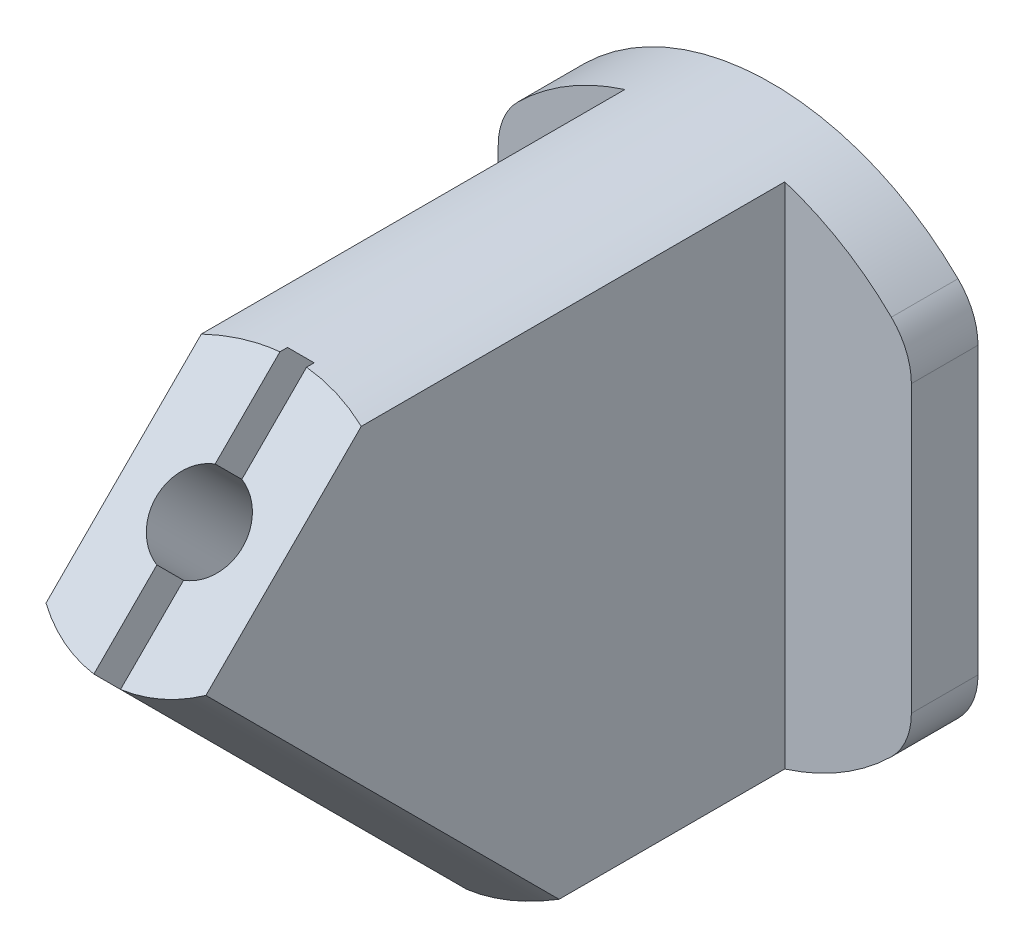
ISO-10303-21;
HEADER;
FILE_DESCRIPTION(('STEP AP214'),'2;1');
FILE_NAME('part.step','',(''),(''),'','','');
FILE_SCHEMA(('AUTOMOTIVE_DESIGN { 1 0 10303 214 1 1 1 1 }'));
ENDSEC;
DATA;
#1=APPLICATION_CONTEXT('core data for automotive mechanical design processes');
#2=APPLICATION_PROTOCOL_DEFINITION('international standard','automotive_design',2000,#1);
#3=PRODUCT_CONTEXT('',#1,'mechanical');
#4=PRODUCT('Part','Part','',(#3));
#5=PRODUCT_RELATED_PRODUCT_CATEGORY('part','',(#4));
#6=PRODUCT_DEFINITION_FORMATION('','',#4);
#7=PRODUCT_DEFINITION_CONTEXT('part definition',#1,'design');
#8=PRODUCT_DEFINITION('design','',#6,#7);
#9=PRODUCT_DEFINITION_SHAPE('','',#8);
#10=(LENGTH_UNIT() NAMED_UNIT(*) SI_UNIT(.MILLI.,.METRE.));
#11=(NAMED_UNIT(*) PLANE_ANGLE_UNIT() SI_UNIT($,.RADIAN.));
#12=(NAMED_UNIT(*) SI_UNIT($,.STERADIAN.) SOLID_ANGLE_UNIT());
#13=UNCERTAINTY_MEASURE_WITH_UNIT(LENGTH_MEASURE(1.E-05),#10,'distance_accuracy_value','');
#14=(GEOMETRIC_REPRESENTATION_CONTEXT(3) GLOBAL_UNCERTAINTY_ASSIGNED_CONTEXT((#13)) GLOBAL_UNIT_ASSIGNED_CONTEXT((#10,
#11,#12)) REPRESENTATION_CONTEXT('',''));
#15=CARTESIAN_POINT('',(0.,0.,0.));
#16=DIRECTION('',(0.,0.,1.));
#17=DIRECTION('',(1.,0.,0.));
#18=AXIS2_PLACEMENT_3D('',#15,#16,#17);
#19=CARTESIAN_POINT('',(0.,0.,50.));
#20=DIRECTION('',(0.,0.,-1.));
#21=DIRECTION('',(-1.,0.,0.));
#22=AXIS2_PLACEMENT_3D('',#19,#20,#21);
#23=CYLINDRICAL_SURFACE('',#22,20.);
#24=DIRECTION('',(0.,0.,-1.));
#25=VECTOR('',#24,1.);
#26=CARTESIAN_POINT('',(-1.00000000000004,-19.9749843554382,50.));
#27=LINE('',#26,#25);
#28=CARTESIAN_POINT('',(-1.00000000000004,-19.9749843554382,14.3982295656959));
#29=VERTEX_POINT('',#28);
#30=CARTESIAN_POINT('',(-1.00000000000004,-19.9749843554382,23.8561759447575));
#31=VERTEX_POINT('',#30);
#32=EDGE_CURVE('E419',#29,#31,#27,.F.);
#33=ORIENTED_EDGE('',*,*,#32,.T.);
#34=CARTESIAN_POINT('',(-1.00000000000005,-19.9749843554382,23.8561759447575));
#35=CARTESIAN_POINT('',(-1.26061484363719,-19.961980122615,23.8315451601963));
#36=CARTESIAN_POINT('',(-1.52005833531843,-19.9438372860367,23.7972385981547));
#37=CARTESIAN_POINT('',(-2.03480101324007,-19.8978867601941,23.7093449996609));
#38=CARTESIAN_POINT('',(-2.29010003174568,-19.8700786807746,23.6557571848823));
#39=CARTESIAN_POINT('',(-2.79473219792378,-19.805410997331,23.5293738184501));
#40=CARTESIAN_POINT('',(-3.04406531315786,-19.7685513441031,23.4565781623835));
#41=CARTESIAN_POINT('',(-3.53496801154571,-19.6866931807613,23.2919293728693));
#42=CARTESIAN_POINT('',(-3.77653805507287,-19.64169515433,23.2000773719375));
#43=CARTESIAN_POINT('',(-4.25052049294367,-19.5446076977182,22.9974067943791));
#44=CARTESIAN_POINT('',(-4.4829197474056,-19.4925085371149,22.8865621382784));
#45=CARTESIAN_POINT('',(-4.93653060131494,-19.3825986027023,22.6463599593305));
#46=CARTESIAN_POINT('',(-5.15774234166405,-19.3247879008545,22.5170026697202));
#47=CARTESIAN_POINT('',(-5.58709268175661,-19.2050514499559,22.2405155355938));
#48=CARTESIAN_POINT('',(-5.79525033598637,-19.1431319836827,22.0934125568282));
#49=CARTESIAN_POINT('',(-6.19737860555173,-19.0167533814306,21.7820755296472));
#50=CARTESIAN_POINT('',(-6.39135475929136,-18.9522952521912,21.6178482303712));
#51=CARTESIAN_POINT('',(-6.74697524903196,-18.8284486095356,21.2889309921683));
#52=CARTESIAN_POINT('',(-6.90995453368032,-18.7691345892171,21.1256524493196));
#53=CARTESIAN_POINT('',(-7.22244179701342,-18.6511189360667,20.7868312406855));
#54=CARTESIAN_POINT('',(-7.37196470116334,-18.5924166902265,20.6113025560532));
#55=CARTESIAN_POINT('',(-7.51453288897558,-18.5346107447797,20.4300189838101));
#56=B_SPLINE_CURVE_WITH_KNOTS('',3,(#34,#35,#36,#37,#38,#39,#40,#41,#42,#43,#44,#45,#46,#47,#48,
#49,#50,#51,#52,#53,#54,#55),.UNSPECIFIED.,.F.,.F.,(4,2,2,2,2,2,2,2,2,2,4),(0.,0.78606803927402,
1.57216781331521,2.35827186064409,3.14432920329607,3.93147468756966,4.7186102556303,
5.50456876715052,6.29021867454424,7.00413334749323,7.71724614573817),.UNSPECIFIED.);
#57=CARTESIAN_POINT('',(-6.,-19.0787840283389,21.9348890760213));
#58=VERTEX_POINT('',#57);
#59=EDGE_CURVE('E267',#31,#58,#56,.T.);
#60=ORIENTED_EDGE('',*,*,#59,.T.);
#61=DIRECTION('',(0.,0.,-1.));
#62=VECTOR('',#61,1.);
#63=CARTESIAN_POINT('',(-5.99999999999999,-19.0787840283389,50.));
#64=LINE('',#63,#62);
#65=CARTESIAN_POINT('',(-6.,-19.0787840283389,5.));
#66=VERTEX_POINT('',#65);
#67=EDGE_CURVE('E299',#58,#66,#64,.T.);
#68=ORIENTED_EDGE('',*,*,#67,.T.);
#69=CARTESIAN_POINT('',(0.,0.,5.));
#70=DIRECTION('',(0.,0.,-1.));
#71=DIRECTION('',(-1.,0.,0.));
#72=AXIS2_PLACEMENT_3D('',#69,#70,#71);
#73=CIRCLE('',#72,20.);
#74=CARTESIAN_POINT('',(-14.,-14.2828568570857,5.));
#75=VERTEX_POINT('',#74);
#76=EDGE_CURVE('E322',#66,#75,#73,.T.);
#77=ORIENTED_EDGE('',*,*,#76,.T.);
#78=DIRECTION('',(0.,0.,-1.));
#79=VECTOR('',#78,1.);
#80=CARTESIAN_POINT('',(-14.,-14.2828568570857,50.));
#81=LINE('',#80,#79);
#82=CARTESIAN_POINT('',(-14.,-14.2828568570857,0.));
#83=VERTEX_POINT('',#82);
#84=EDGE_CURVE('E361',#75,#83,#81,.T.);
#85=ORIENTED_EDGE('',*,*,#84,.T.);
#86=CARTESIAN_POINT('',(0.,0.,0.));
#87=DIRECTION('',(0.,0.,1.));
#88=DIRECTION('',(1.,0.,0.));
#89=AXIS2_PLACEMENT_3D('',#86,#87,#88);
#90=CIRCLE('',#89,20.);
#91=CARTESIAN_POINT('',(-1.00000000000002,-19.9749843554382,0.));
#92=VERTEX_POINT('',#91);
#93=EDGE_CURVE('E335',#83,#92,#90,.T.);
#94=ORIENTED_EDGE('',*,*,#93,.T.);
#95=DIRECTION('',(0.,0.,-1.));
#96=VECTOR('',#95,1.);
#97=CARTESIAN_POINT('',(-1.00000000000001,-19.9749843554382,50.));
#98=LINE('',#97,#96);
#99=CARTESIAN_POINT('',(-1.00000000000002,-19.9749843554382,5.65180172342793));
#100=VERTEX_POINT('',#99);
#101=EDGE_CURVE('E407',#92,#100,#98,.F.);
#102=ORIENTED_EDGE('',*,*,#101,.T.);
#103=CARTESIAN_POINT('',(-1.00000000000002,-19.9749843554382,5.65180172342794));
#104=CARTESIAN_POINT('',(-1.08629569947696,-19.970663732977,5.69559259696993));
#105=CARTESIAN_POINT('',(-1.16992749671595,-19.9659170944513,5.74422186994058));
#106=CARTESIAN_POINT('',(-1.33153417565213,-19.9557899028421,5.84965134634467));
#107=CARTESIAN_POINT('',(-1.40952356597202,-19.9504110762577,5.9064293853275));
#108=CARTESIAN_POINT('',(-1.6333238712017,-19.9337530831377,6.08562699393922));
#109=CARTESIAN_POINT('',(-1.77112341003954,-19.9218342612897,6.21807312897105));
#110=CARTESIAN_POINT('',(-1.98445005016143,-19.9014929564505,6.45550505881144));
#111=CARTESIAN_POINT('',(-2.06572049945984,-19.8931837167284,6.55555526209226));
#112=CARTESIAN_POINT('',(-2.21922182150329,-19.8766449139061,6.76241395397263));
#113=CARTESIAN_POINT('',(-2.29145143469506,-19.8684153620549,6.8692233811414));
#114=CARTESIAN_POINT('',(-2.42773294950043,-19.8522253545787,7.08885451341318));
#115=CARTESIAN_POINT('',(-2.49173014004184,-19.8442669342168,7.20171002314491));
#116=CARTESIAN_POINT('',(-2.61146834849368,-19.82886459313,7.43176487697476));
#117=CARTESIAN_POINT('',(-2.66720727778306,-19.8214208028147,7.54896531062199));
#118=CARTESIAN_POINT('',(-2.79031596506596,-19.8045282738447,7.83174654513227));
#119=CARTESIAN_POINT('',(-2.85413841282428,-19.7953828368126,7.99889598454517));
#120=CARTESIAN_POINT('',(-2.96740856203989,-19.7787196902751,8.33809189766015));
#121=CARTESIAN_POINT('',(-3.01685144961036,-19.7712025260856,8.51013999018446));
#122=CARTESIAN_POINT('',(-3.10163845886224,-19.7580787884182,8.85765064382754));
#123=CARTESIAN_POINT('',(-3.13698951484036,-19.752471275439,9.03311148091393));
#124=CARTESIAN_POINT('',(-3.19364902680687,-19.7433894653863,9.38631405419236));
#125=CARTESIAN_POINT('',(-3.21495928687065,-19.739914894259,9.56405549436095));
#126=CARTESIAN_POINT('',(-3.24348831708312,-19.735247609011,9.92303715751965));
#127=CARTESIAN_POINT('',(-3.25051991243593,-19.7340852084308,10.1042927968312));
#128=CARTESIAN_POINT('',(-3.24942023234832,-19.7342663928387,10.4668046783236));
#129=CARTESIAN_POINT('',(-3.24128626947262,-19.7356104219825,10.6480609149184));
#130=CARTESIAN_POINT('',(-3.20911658222875,-19.740867422648,11.0088659360037));
#131=CARTESIAN_POINT('',(-3.18510614966525,-19.7447763081826,11.1884169762173));
#132=CARTESIAN_POINT('',(-3.12026552032932,-19.7551260729563,11.5442970938017));
#133=CARTESIAN_POINT('',(-3.079444341686,-19.7615655945506,11.7206278458117));
#134=CARTESIAN_POINT('',(-2.96392332335854,-19.7792743268441,12.123689665123));
#135=CARTESIAN_POINT('',(-2.88256809485607,-19.7914291093371,12.3485381593494));
#136=CARTESIAN_POINT('',(-2.68590424438739,-19.8190760099549,12.7827108238843));
#137=CARTESIAN_POINT('',(-2.57063347788327,-19.8345644020618,12.9920519786288));
#138=CARTESIAN_POINT('',(-2.33102897533197,-19.8639805452796,13.346842942818));
#139=CARTESIAN_POINT('',(-2.21317446907071,-19.8775961950206,13.4966771309514));
#140=CARTESIAN_POINT('',(-1.95472527932886,-19.9046688492604,13.774937933541));
#141=CARTESIAN_POINT('',(-1.81419450288269,-19.9181261887792,13.9034227082717));
#142=CARTESIAN_POINT('',(-1.56157904297354,-19.9392027434648,14.0951348638056));
#143=CARTESIAN_POINT('',(-1.45526236780157,-19.9472900315657,14.1659498854087));
#144=CARTESIAN_POINT('',(-1.23386214711476,-19.9622152298095,14.2933691517613));
#145=CARTESIAN_POINT('',(-1.11874837764825,-19.969048530666,14.3499212443625));
#146=CARTESIAN_POINT('',(-1.00000000000004,-19.9749843554382,14.3982295656959));
#147=B_SPLINE_CURVE_WITH_KNOTS('',3,(#103,#104,#105,#106,#107,#108,#109,#110,#111,#112,#113,
#114,#115,#116,#117,#118,#119,#120,#121,#122,#123,#124,#125,#126,#127,#128,#129,#130,#131,#132,
#133,#134,#135,#136,#137,#138,#139,#140,#141,#142,#143,#144,#145,#146),.UNSPECIFIED.,.F.,.F.,(4,
2,2,2,2,2,2,2,2,2,2,2,2,2,2,2,2,2,2,2,2,4),(0.,0.290180291759194,0.579585754191035,
1.1511570716551,1.53823577051911,1.92536833662024,2.31495366572505,2.70463735841513,
3.24136011100491,3.77826233753334,4.3149000385568,4.85146877456127,5.39502697193631,
5.93868150050494,6.48147204706747,7.02397179202366,7.73967456257339,8.45458149912549,
9.02578544862269,9.59540685899327,9.97837609645326,10.3627259896295),.UNSPECIFIED.);
#148=EDGE_CURVE('E408',#100,#29,#147,.T.);
#149=ORIENTED_EDGE('',*,*,#148,.T.);
#150=EDGE_LOOP('',(#33,#60,#68,#77,#85,#94,#102,#149));
#151=FACE_BOUND('',#150,.T.);
#152=ADVANCED_FACE('F33',(#151),#23,.T.);
#153=CARTESIAN_POINT('',(-106.800882059162,1.59436989053374,54.2634944857353));
#154=DIRECTION('',(0.,-0.707106781186547,-0.707106781186548));
#155=DIRECTION('',(0.,0.707106781186548,-0.707106781186547));
#156=AXIS2_PLACEMENT_3D('',#153,#154,#155);
#157=PLANE('',#156);
#158=DIRECTION('',(0.,0.707106781186548,-0.707106781186547));
#159=VECTOR('',#158,1.);
#160=CARTESIAN_POINT('',(-6.,76.5869623694745,-20.7290979932054));
#161=LINE('',#160,#159);
#162=CARTESIAN_POINT('',(-6.,7.42209563595442,48.4357687403147));
#163=VERTEX_POINT('',#162);
#164=CARTESIAN_POINT('',(-5.99999999999999,19.0787840283389,36.7790803479301));
#165=VERTEX_POINT('',#164);
#166=EDGE_CURVE('E56',#163,#165,#161,.T.);
#167=ORIENTED_EDGE('',*,*,#166,.F.);
#168=CARTESIAN_POINT('',(0.,12.9289321881345,42.9289321881346));
#169=DIRECTION('',(0.,-0.707106781186548,-0.707106781186547));
#170=DIRECTION('',(0.,-0.707106781186547,0.707106781186548));
#171=AXIS2_PLACEMENT_3D('',#168,#169,#170);
#172=CIRCLE('',#171,9.83109849532861);
#173=CARTESIAN_POINT('',(-1.00000000000004,6.01335203803672,49.8445123382324));
#174=VERTEX_POINT('',#173);
#175=EDGE_CURVE('E212',#174,#163,#172,.T.);
#176=ORIENTED_EDGE('',*,*,#175,.F.);
#177=DIRECTION('',(0.,-0.707106781186548,0.707106781186547));
#178=VECTOR('',#177,1.);
#179=CARTESIAN_POINT('',(-1.00000000000004,6.01335203803672,49.8445123382324));
#180=LINE('',#179,#178);
#181=CARTESIAN_POINT('',(-1.00000000000004,10.7423252275675,45.1155391487016));
#182=VERTEX_POINT('',#181);
#183=EDGE_CURVE('E199',#182,#174,#180,.T.);
#184=ORIENTED_EDGE('',*,*,#183,.F.);
#185=CARTESIAN_POINT('',(0.,12.9289321881345,42.9289321881346));
#186=DIRECTION('',(0.,0.707106781186548,0.707106781186547));
#187=DIRECTION('',(0.,-0.707106781186547,0.707106781186548));
#188=AXIS2_PLACEMENT_3D('',#185,#186,#187);
#189=CIRCLE('',#188,3.25);
#190=CARTESIAN_POINT('',(-1.00000000000001,15.1155391487015,40.7423252275676));
#191=VERTEX_POINT('',#190);
#192=EDGE_CURVE('E219',#191,#182,#189,.T.);
#193=ORIENTED_EDGE('',*,*,#192,.F.);
#194=DIRECTION('',(0.,0.707106781186548,-0.707106781186547));
#195=VECTOR('',#194,1.);
#196=CARTESIAN_POINT('',(-1.,1.59436989053375,54.2634944857353));
#197=LINE('',#196,#195);
#198=CARTESIAN_POINT('',(-1.00000000000002,19.9749843554382,35.8828800208309));
#199=VERTEX_POINT('',#198);
#200=EDGE_CURVE('E41',#191,#199,#197,.T.);
#201=ORIENTED_EDGE('',*,*,#200,.T.);
#202=CARTESIAN_POINT('',(0.,0.,55.857864376269));
#203=DIRECTION('',(0.,-0.707106781186547,-0.707106781186548));
#204=DIRECTION('',(0.,0.707106781186548,-0.707106781186547));
#205=AXIS2_PLACEMENT_3D('',#202,#203,#204);
#206=ELLIPSE('',#205,28.2842712474619,20.);
#207=EDGE_CURVE('E280',#165,#199,#206,.T.);
#208=ORIENTED_EDGE('',*,*,#207,.F.);
#209=EDGE_LOOP('',(#167,#176,#184,#193,#201,#208));
#210=FACE_BOUND('',#209,.T.);
#211=ADVANCED_FACE('F264',(#210),#157,.F.);
#212=CARTESIAN_POINT('',(0.999999999999985,19.9749843554382,35.8828800208309));
#213=VERTEX_POINT('',#212);
#214=CARTESIAN_POINT('',(6.00000000000001,19.0787840283389,36.7790803479301));
#215=VERTEX_POINT('',#214);
#216=EDGE_CURVE('E279',#213,#215,#206,.T.);
#217=ORIENTED_EDGE('',*,*,#216,.F.);
#218=DIRECTION('',(0.,0.707106781186547,-0.707106781186547));
#219=VECTOR('',#218,1.);
#220=CARTESIAN_POINT('',(0.999999999999985,15.1155391487015,40.7423252275676));
#221=LINE('',#220,#219);
#222=CARTESIAN_POINT('',(0.999999999999985,15.1155391487015,40.7423252275676));
#223=VERTEX_POINT('',#222);
#224=EDGE_CURVE('E214',#223,#213,#221,.T.);
#225=ORIENTED_EDGE('',*,*,#224,.F.);
#226=CARTESIAN_POINT('',(0.,12.9289321881345,42.9289321881346));
#227=DIRECTION('',(0.,0.707106781186548,0.707106781186547));
#228=DIRECTION('',(0.,-0.707106781186547,0.707106781186548));
#229=AXIS2_PLACEMENT_3D('',#226,#227,#228);
#230=CIRCLE('',#229,3.25000000000001);
#231=CARTESIAN_POINT('',(0.999999999999962,10.7423252275675,45.1155391487016));
#232=VERTEX_POINT('',#231);
#233=EDGE_CURVE('E211',#232,#223,#230,.T.);
#234=ORIENTED_EDGE('',*,*,#233,.F.);
#235=DIRECTION('',(0.,0.707106781186548,-0.707106781186548));
#236=VECTOR('',#235,1.);
#237=CARTESIAN_POINT('',(0.999999999999963,6.01335203803672,49.8445123382324));
#238=LINE('',#237,#236);
#239=CARTESIAN_POINT('',(0.999999999999963,6.01335203803672,49.8445123382324));
#240=VERTEX_POINT('',#239);
#241=EDGE_CURVE('E193',#240,#232,#238,.T.);
#242=ORIENTED_EDGE('',*,*,#241,.F.);
#243=CARTESIAN_POINT('',(0.,12.9289321881345,42.9289321881346));
#244=DIRECTION('',(0.,-0.707106781186547,-0.707106781186548));
#245=DIRECTION('',(0.,0.707106781186548,-0.707106781186547));
#246=AXIS2_PLACEMENT_3D('',#243,#244,#245);
#247=CIRCLE('',#246,9.83109849532864);
#248=CARTESIAN_POINT('',(6.00000000000001,7.42209563595444,48.4357687403146));
#249=VERTEX_POINT('',#248);
#250=EDGE_CURVE('E201',#240,#249,#247,.F.);
#251=ORIENTED_EDGE('',*,*,#250,.T.);
#252=DIRECTION('',(0.,-0.707106781186548,0.707106781186547));
#253=VECTOR('',#252,1.);
#254=CARTESIAN_POINT('',(6.00000000000001,52.208573355544,3.64929102072501));
#255=LINE('',#254,#253);
#256=EDGE_CURVE('E283',#215,#249,#255,.T.);
#257=ORIENTED_EDGE('',*,*,#256,.F.);
#258=EDGE_LOOP('',(#217,#225,#234,#242,#251,#257));
#259=FACE_BOUND('',#258,.T.);
#260=ADVANCED_FACE('F208',(#259),#157,.F.);
#261=CARTESIAN_POINT('',(-10.5,10.7121426428143,50.));
#262=DIRECTION('',(0.,0.,-1.));
#263=DIRECTION('',(-1.,0.,0.));
#264=AXIS2_PLACEMENT_3D('',#261,#262,#263);
#265=CYLINDRICAL_SURFACE('',#264,5.);
#266=DIRECTION('',(0.,0.,-1.));
#267=VECTOR('',#266,1.);
#268=CARTESIAN_POINT('',(-15.5,10.7121426428143,50.));
#269=LINE('',#268,#267);
#270=CARTESIAN_POINT('',(-15.5,10.7121426428143,5.));
#271=VERTEX_POINT('',#270);
#272=CARTESIAN_POINT('',(-15.5,10.7121426428143,0.));
#273=VERTEX_POINT('',#272);
#274=EDGE_CURVE('E365',#271,#273,#269,.T.);
#275=ORIENTED_EDGE('',*,*,#274,.F.);
#276=CARTESIAN_POINT('',(-10.5,10.7121426428143,5.));
#277=DIRECTION('',(0.,0.,-1.));
#278=DIRECTION('',(-1.,0.,0.));
#279=AXIS2_PLACEMENT_3D('',#276,#277,#278);
#280=CIRCLE('',#279,5.);
#281=CARTESIAN_POINT('',(-14.,14.2828568570857,5.));
#282=VERTEX_POINT('',#281);
#283=EDGE_CURVE('E313',#271,#282,#280,.T.);
#284=ORIENTED_EDGE('',*,*,#283,.T.);
#285=DIRECTION('',(0.,0.,-1.));
#286=VECTOR('',#285,1.);
#287=CARTESIAN_POINT('',(-14.,14.2828568570857,50.));
#288=LINE('',#287,#286);
#289=CARTESIAN_POINT('',(-14.,14.2828568570857,0.));
#290=VERTEX_POINT('',#289);
#291=EDGE_CURVE('E350',#282,#290,#288,.T.);
#292=ORIENTED_EDGE('',*,*,#291,.T.);
#293=CARTESIAN_POINT('',(-10.5,10.7121426428143,0.));
#294=DIRECTION('',(0.,0.,1.));
#295=DIRECTION('',(-1.,0.,0.));
#296=AXIS2_PLACEMENT_3D('',#293,#294,#295);
#297=CIRCLE('',#296,5.);
#298=EDGE_CURVE('E325',#290,#273,#297,.T.);
#299=ORIENTED_EDGE('',*,*,#298,.T.);
#300=EDGE_LOOP('',(#275,#284,#292,#299));
#301=FACE_BOUND('',#300,.T.);
#302=ADVANCED_FACE('F35',(#301),#265,.T.);
#303=CARTESIAN_POINT('',(-15.5,10.7121426428143,50.));
#304=DIRECTION('',(1.,0.,0.));
#305=DIRECTION('',(0.,1.,0.));
#306=AXIS2_PLACEMENT_3D('',#303,#304,#305);
#307=PLANE('',#306);
#308=DIRECTION('',(0.,0.,-1.));
#309=VECTOR('',#308,1.);
#310=CARTESIAN_POINT('',(-15.5,-10.7121426428143,50.));
#311=LINE('',#310,#309);
#312=CARTESIAN_POINT('',(-15.5,-10.7121426428143,5.));
#313=VERTEX_POINT('',#312);
#314=CARTESIAN_POINT('',(-15.5,-10.7121426428143,0.));
#315=VERTEX_POINT('',#314);
#316=EDGE_CURVE('E363',#313,#315,#311,.T.);
#317=ORIENTED_EDGE('',*,*,#316,.F.);
#318=DIRECTION('',(0.,1.,0.));
#319=VECTOR('',#318,1.);
#320=CARTESIAN_POINT('',(-15.5,10.7121426428143,5.));
#321=LINE('',#320,#319);
#322=EDGE_CURVE('E316',#313,#271,#321,.T.);
#323=ORIENTED_EDGE('',*,*,#322,.T.);
#324=ORIENTED_EDGE('',*,*,#274,.T.);
#325=DIRECTION('',(0.,-1.,0.));
#326=VECTOR('',#325,1.);
#327=CARTESIAN_POINT('',(-15.5,10.7121426428143,0.));
#328=LINE('',#327,#326);
#329=EDGE_CURVE('E328',#273,#315,#328,.T.);
#330=ORIENTED_EDGE('',*,*,#329,.T.);
#331=EDGE_LOOP('',(#317,#323,#324,#330));
#332=FACE_BOUND('',#331,.T.);
#333=ADVANCED_FACE('F473',(#332),#307,.F.);
#334=CARTESIAN_POINT('',(-10.5,-10.7121426428143,50.));
#335=DIRECTION('',(0.,0.,-1.));
#336=DIRECTION('',(-1.,0.,0.));
#337=AXIS2_PLACEMENT_3D('',#334,#335,#336);
#338=CYLINDRICAL_SURFACE('',#337,5.);
#339=ORIENTED_EDGE('',*,*,#84,.F.);
#340=CARTESIAN_POINT('',(-10.5,-10.7121426428143,5.));
#341=DIRECTION('',(0.,0.,-1.));
#342=DIRECTION('',(-1.,0.,0.));
#343=AXIS2_PLACEMENT_3D('',#340,#341,#342);
#344=CIRCLE('',#343,5.);
#345=EDGE_CURVE('E319',#75,#313,#344,.T.);
#346=ORIENTED_EDGE('',*,*,#345,.T.);
#347=ORIENTED_EDGE('',*,*,#316,.T.);
#348=CARTESIAN_POINT('',(-10.5,-10.7121426428143,0.));
#349=DIRECTION('',(0.,0.,1.));
#350=DIRECTION('',(-1.,0.,0.));
#351=AXIS2_PLACEMENT_3D('',#348,#349,#350);
#352=CIRCLE('',#351,5.);
#353=EDGE_CURVE('E331',#315,#83,#352,.T.);
#354=ORIENTED_EDGE('',*,*,#353,.T.);
#355=EDGE_LOOP('',(#339,#346,#347,#354));
#356=FACE_BOUND('',#355,.T.);
#357=ADVANCED_FACE('F395',(#356),#338,.T.);
#358=CARTESIAN_POINT('',(0.999999999999958,-19.9749843554382,14.3982295656959));
#359=CARTESIAN_POINT('',(1.08309943391349,-19.9708273263609,14.3644051114189));
#360=CARTESIAN_POINT('',(1.16448348097414,-19.9662300926852,14.3265302725674));
#361=CARTESIAN_POINT('',(1.32323641218614,-19.9563355791693,14.2434007207358));
#362=CARTESIAN_POINT('',(1.40060969302619,-19.9510390894802,14.1981543242196));
#363=CARTESIAN_POINT('',(1.55033069822167,-19.9399617876196,14.1013211174988));
#364=CARTESIAN_POINT('',(1.62271433271063,-19.9341852883141,14.0497891585875));
#365=CARTESIAN_POINT('',(1.76283118120077,-19.9222832152384,13.940790391359));
#366=CARTESIAN_POINT('',(1.83056315543115,-19.9161575491976,13.8833220109947));
#367=CARTESIAN_POINT('',(2.02581958534337,-19.897565585245,13.7035777608381));
#368=CARTESIAN_POINT('',(2.14619258720513,-19.8848228600582,13.5734421306163));
#369=CARTESIAN_POINT('',(2.36714568226862,-19.8597337204937,13.2971019100972));
#370=CARTESIAN_POINT('',(2.46767732216745,-19.8473883364327,13.1508593090841));
#371=CARTESIAN_POINT('',(2.6921580240988,-19.8184419004031,12.774542624273));
#372=CARTESIAN_POINT('',(2.80466100762493,-19.8025931148026,12.5375583005929));
#373=CARTESIAN_POINT('',(2.9902377648534,-19.7754203299436,12.0483563666018));
#374=CARTESIAN_POINT('',(3.06324184254092,-19.7641043378947,11.796112697102));
#375=CARTESIAN_POINT('',(3.15412141984755,-19.7497525612701,11.3729399492929));
#376=CARTESIAN_POINT('',(3.18233622678934,-19.7452060882847,11.2041679291963));
#377=CARTESIAN_POINT('',(3.22428333692096,-19.7384009628009,10.8647879113649));
#378=CARTESIAN_POINT('',(3.23801624126664,-19.7361422153374,10.6941799901368));
#379=CARTESIAN_POINT('',(3.25171596186807,-19.7338891491343,10.3522689394469));
#380=CARTESIAN_POINT('',(3.25167023542481,-19.7338968935841,10.1809653185093));
#381=CARTESIAN_POINT('',(3.23831317400647,-19.7360931665682,9.83891650900548));
#382=CARTESIAN_POINT('',(3.22500319437094,-19.738281472293,9.66817126517279));
#383=CARTESIAN_POINT('',(3.18515578903495,-19.7447511101505,9.32573021705338));
#384=CARTESIAN_POINT('',(3.15842703243115,-19.7490626995384,9.15405726098273));
#385=CARTESIAN_POINT('',(3.09176117521729,-19.7596091001104,8.81332665701793));
#386=CARTESIAN_POINT('',(3.05182203216057,-19.7658442086781,8.64426941777102));
#387=CARTESIAN_POINT('',(2.95858983336806,-19.7800146037173,8.30988628205706));
#388=CARTESIAN_POINT('',(2.90529412578622,-19.787950227768,8.14456113368262));
#389=CARTESIAN_POINT('',(2.78499677092803,-19.8052384482535,7.81914552972558));
#390=CARTESIAN_POINT('',(2.7180005794339,-19.8145904802656,7.65905301975336));
#391=CARTESIAN_POINT('',(2.54477437345051,-19.8376967275674,7.29328589637239));
#392=CARTESIAN_POINT('',(2.43291106233684,-19.8518790125195,7.09021231353158));
#393=CARTESIAN_POINT('',(2.24451240591393,-19.8737534696668,6.79982727892798));
#394=CARTESIAN_POINT('',(2.17846572287625,-19.8811263335611,6.70561672487122));
#395=CARTESIAN_POINT('',(2.03909147061228,-19.895904869409,6.52275253813905));
#396=CARTESIAN_POINT('',(1.96576375369825,-19.9033105420252,6.43409901824148));
#397=CARTESIAN_POINT('',(1.76241380700114,-19.9225997394516,6.20948040878453));
#398=CARTESIAN_POINT('',(1.62590396172749,-19.9343478798865,6.0791226337851));
#399=CARTESIAN_POINT('',(1.40449106835079,-19.9507629307952,5.90270178574542));
#400=CARTESIAN_POINT('',(1.32740056011803,-19.9560613811595,5.84680536924096));
#401=CARTESIAN_POINT('',(1.1677467698759,-19.9660407662389,5.742954896422));
#402=CARTESIAN_POINT('',(1.08517008763295,-19.9707200986935,5.69502136905447));
#403=CARTESIAN_POINT('',(1.00000000000002,-19.9749843554382,5.65180172342792));
#404=B_SPLINE_CURVE_WITH_KNOTS('',3,(#358,#359,#360,#361,#362,#363,#364,#365,#366,#367,#368,
#369,#370,#371,#372,#373,#374,#375,#376,#377,#378,#379,#380,#381,#382,#383,#384,#385,#386,#387,
#388,#389,#390,#391,#392,#393,#394,#395,#396,#397,#398,#399,#400,#401,#402,#403),.UNSPECIFIED.,
.F.,.F.,(4,2,2,2,2,2,2,2,2,2,2,2,2,2,2,2,2,2,2,2,2,2,4),(0.,0.26927905916395,0.538256399716448,
0.805035056934124,1.07188454285029,1.60277815917949,2.13495261684007,2.91907318641967,
3.70457286541395,4.2174973405839,4.73040052299251,5.24377060300161,5.7570882323049,
6.27794217727792,6.79887668870939,7.31991470984681,7.84074564678988,8.53524657409563,
8.88080781501584,9.2263760666972,9.79086480296107,10.0765436944216,10.3629480272789),.UNSPECIFIED.);
#405=CARTESIAN_POINT('',(0.99999999999996,-19.9749843554382,14.3982295656959));
#406=VERTEX_POINT('',#405);
#407=CARTESIAN_POINT('',(0.99999999999998,-19.9749843554382,5.65180172342795));
#408=VERTEX_POINT('',#407);
#409=EDGE_CURVE('E439',#406,#408,#404,.T.);
#410=ORIENTED_EDGE('',*,*,#409,.T.);
#411=DIRECTION('',(0.,0.,-1.));
#412=VECTOR('',#411,1.);
#413=CARTESIAN_POINT('',(0.999999999999982,-19.9749843554382,50.));
#414=LINE('',#413,#412);
#415=CARTESIAN_POINT('',(0.999999999999981,-19.9749843554382,0.));
#416=VERTEX_POINT('',#415);
#417=EDGE_CURVE('E447',#408,#416,#414,.T.);
#418=ORIENTED_EDGE('',*,*,#417,.T.);
#419=CARTESIAN_POINT('',(14.,-14.2828568570857,0.));
#420=VERTEX_POINT('',#419);
#421=EDGE_CURVE('E334',#416,#420,#90,.T.);
#422=ORIENTED_EDGE('',*,*,#421,.T.);
#423=DIRECTION('',(0.,0.,-1.));
#424=VECTOR('',#423,1.);
#425=CARTESIAN_POINT('',(14.,-14.2828568570857,50.));
#426=LINE('',#425,#424);
#427=CARTESIAN_POINT('',(14.,-14.2828568570857,5.));
#428=VERTEX_POINT('',#427);
#429=EDGE_CURVE('E358',#428,#420,#426,.T.);
#430=ORIENTED_EDGE('',*,*,#429,.F.);
#431=CARTESIAN_POINT('',(0.,0.,5.));
#432=DIRECTION('',(0.,0.,-1.));
#433=DIRECTION('',(-1.,0.,0.));
#434=AXIS2_PLACEMENT_3D('',#431,#432,#433);
#435=CIRCLE('',#434,20.);
#436=CARTESIAN_POINT('',(6.,-19.0787840283389,5.));
#437=VERTEX_POINT('',#436);
#438=EDGE_CURVE('E310',#428,#437,#435,.T.);
#439=ORIENTED_EDGE('',*,*,#438,.T.);
#440=DIRECTION('',(0.,0.,-1.));
#441=VECTOR('',#440,1.);
#442=CARTESIAN_POINT('',(6.00000000000001,-19.0787840283389,50.));
#443=LINE('',#442,#441);
#444=CARTESIAN_POINT('',(6.00000000000001,-19.0787840283389,21.9348890760213));
#445=VERTEX_POINT('',#444);
#446=EDGE_CURVE('E293',#437,#445,#443,.F.);
#447=ORIENTED_EDGE('',*,*,#446,.T.);
#448=CARTESIAN_POINT('',(9.29392882690882,-17.7094010898266,16.8234533276913));
#449=CARTESIAN_POINT('',(9.21814810518967,-17.7491272537367,17.0945634259947));
#450=CARTESIAN_POINT('',(9.13331491097292,-17.793069163275,17.3626332588574));
#451=CARTESIAN_POINT('',(8.94464557930893,-17.8886817075979,17.89081910672));
#452=CARTESIAN_POINT('',(8.8407939900257,-17.9403586205431,18.1509284520543));
#453=CARTESIAN_POINT('',(8.61306145856946,-18.0507920904557,18.6614297902238));
#454=CARTESIAN_POINT('',(8.48913709641536,-18.1095639228253,18.9117992247156));
#455=CARTESIAN_POINT('',(8.22105750233794,-18.2328272559827,19.3999139378202));
#456=CARTESIAN_POINT('',(8.07690809107953,-18.2973171091952,19.6376628215235));
#457=CARTESIAN_POINT('',(7.76755961174559,-18.4307762756594,20.0996521062085));
#458=CARTESIAN_POINT('',(7.60225414641745,-18.499767301261,20.3238151496466));
#459=CARTESIAN_POINT('',(7.2516794063148,-18.6399776899395,20.7552569727696));
#460=CARTESIAN_POINT('',(7.06640791957954,-18.7111972992914,20.9625338772264));
#461=CARTESIAN_POINT('',(6.67726098352071,-18.8535676447533,21.358050350074));
#462=CARTESIAN_POINT('',(6.47342047437307,-18.92471826565,21.5463243227491));
#463=CARTESIAN_POINT('',(6.04825355387676,-19.0648550347502,21.902836949252));
#464=CARTESIAN_POINT('',(5.82692901805999,-19.1338414140083,22.0710777472203));
#465=CARTESIAN_POINT('',(5.38722251824211,-19.2620331438509,22.3735953665029));
#466=CARTESIAN_POINT('',(5.1700722209802,-19.3215773618311,22.5095230291742));
#467=CARTESIAN_POINT('',(4.72399424588288,-19.4354535971434,22.7629877989461));
#468=CARTESIAN_POINT('',(4.49506680063177,-19.4897857173473,22.8805252690456));
#469=CARTESIAN_POINT('',(4.02700886535826,-19.5918496928964,23.0968184238145));
#470=CARTESIAN_POINT('',(3.78787554626987,-19.6395797023829,23.1955688587743));
#471=CARTESIAN_POINT('',(3.30129152629112,-19.7272046494429,23.3739418488273));
#472=CARTESIAN_POINT('',(3.05384311079907,-19.7671017195967,23.453569611542));
#473=CARTESIAN_POINT('',(2.50928360566408,-19.8441778209432,23.6055687929058));
#474=CARTESIAN_POINT('',(2.21092513224937,-19.8797210929826,23.6743618249337));
#475=CARTESIAN_POINT('',(1.75928517128955,-19.9230465507914,23.7575188904441));
#476=CARTESIAN_POINT('',(1.6082344604971,-19.9358143127991,23.7818822741987));
#477=CARTESIAN_POINT('',(1.30493201370746,-19.9579629099341,23.8239932859335));
#478=CARTESIAN_POINT('',(1.1526800145079,-19.967342980504,23.8417394205168));
#479=CARTESIAN_POINT('',(0.999999999999959,-19.9749843554382,23.8561759447575));
#480=B_SPLINE_CURVE_WITH_KNOTS('',3,(#448,#449,#450,#451,#452,#453,#454,#455,#456,#457,#458,
#459,#460,#461,#462,#463,#464,#465,#466,#467,#468,#469,#470,#471,#472,#473,#474,#475,#476,#477,
#478,#479),.UNSPECIFIED.,.F.,.F.,(4,2,2,2,2,2,2,2,2,2,2,2,2,2,2,4),(0.,0.852838655877133,
1.70637331494434,2.56177956003447,3.41694012666378,4.27658414398284,5.13632349614002,
5.99447728907258,6.85253915152525,7.64063289595651,8.42871108246764,9.21700916128635,
10.0050923211354,10.9281467987226,11.3885946418398,11.8491463371452),.UNSPECIFIED.);
#481=CARTESIAN_POINT('',(0.99999999999996,-19.9749843554382,23.8561759447575));
#482=VERTEX_POINT('',#481);
#483=EDGE_CURVE('E240',#445,#482,#480,.T.);
#484=ORIENTED_EDGE('',*,*,#483,.T.);
#485=DIRECTION('',(0.,0.,-1.));
#486=VECTOR('',#485,1.);
#487=CARTESIAN_POINT('',(0.999999999999961,-19.9749843554382,50.));
#488=LINE('',#487,#486);
#489=EDGE_CURVE('E196',#482,#406,#488,.T.);
#490=ORIENTED_EDGE('',*,*,#489,.T.);
#491=EDGE_LOOP('',(#410,#418,#422,#430,#439,#447,#484,#490));
#492=FACE_BOUND('',#491,.T.);
#493=ADVANCED_FACE('F248',(#492),#23,.T.);
#494=CARTESIAN_POINT('',(10.5,-10.7121426428143,50.));
#495=DIRECTION('',(0.,0.,-1.));
#496=DIRECTION('',(-1.,0.,0.));
#497=AXIS2_PLACEMENT_3D('',#494,#495,#496);
#498=CYLINDRICAL_SURFACE('',#497,5.);
#499=DIRECTION('',(0.,0.,-1.));
#500=VECTOR('',#499,1.);
#501=CARTESIAN_POINT('',(15.5,-10.7121426428143,50.));
#502=LINE('',#501,#500);
#503=CARTESIAN_POINT('',(15.5,-10.7121426428143,5.));
#504=VERTEX_POINT('',#503);
#505=CARTESIAN_POINT('',(15.5,-10.7121426428143,0.));
#506=VERTEX_POINT('',#505);
#507=EDGE_CURVE('E356',#504,#506,#502,.T.);
#508=ORIENTED_EDGE('',*,*,#507,.F.);
#509=CARTESIAN_POINT('',(10.5,-10.7121426428143,5.));
#510=DIRECTION('',(0.,0.,-1.));
#511=DIRECTION('',(-1.,0.,0.));
#512=AXIS2_PLACEMENT_3D('',#509,#510,#511);
#513=CIRCLE('',#512,5.);
#514=EDGE_CURVE('E307',#504,#428,#513,.T.);
#515=ORIENTED_EDGE('',*,*,#514,.T.);
#516=ORIENTED_EDGE('',*,*,#429,.T.);
#517=CARTESIAN_POINT('',(10.5,-10.7121426428143,0.));
#518=DIRECTION('',(0.,0.,1.));
#519=DIRECTION('',(-1.,0.,0.));
#520=AXIS2_PLACEMENT_3D('',#517,#518,#519);
#521=CIRCLE('',#520,5.);
#522=EDGE_CURVE('E338',#420,#506,#521,.T.);
#523=ORIENTED_EDGE('',*,*,#522,.T.);
#524=EDGE_LOOP('',(#508,#515,#516,#523));
#525=FACE_BOUND('',#524,.T.);
#526=ADVANCED_FACE('F484',(#525),#498,.T.);
#527=CARTESIAN_POINT('',(15.5,10.7121426428143,50.));
#528=DIRECTION('',(-1.,0.,0.));
#529=DIRECTION('',(0.,-1.,0.));
#530=AXIS2_PLACEMENT_3D('',#527,#528,#529);
#531=PLANE('',#530);
#532=DIRECTION('',(0.,0.,-1.));
#533=VECTOR('',#532,1.);
#534=CARTESIAN_POINT('',(15.5,10.7121426428143,50.));
#535=LINE('',#534,#533);
#536=CARTESIAN_POINT('',(15.5,10.7121426428143,5.));
#537=VERTEX_POINT('',#536);
#538=CARTESIAN_POINT('',(15.5,10.7121426428143,0.));
#539=VERTEX_POINT('',#538);
#540=EDGE_CURVE('E354',#537,#539,#535,.T.);
#541=ORIENTED_EDGE('',*,*,#540,.F.);
#542=DIRECTION('',(0.,-1.,0.));
#543=VECTOR('',#542,1.);
#544=CARTESIAN_POINT('',(15.5,10.7121426428143,5.));
#545=LINE('',#544,#543);
#546=EDGE_CURVE('E304',#537,#504,#545,.T.);
#547=ORIENTED_EDGE('',*,*,#546,.T.);
#548=ORIENTED_EDGE('',*,*,#507,.T.);
#549=DIRECTION('',(0.,1.,0.));
#550=VECTOR('',#549,1.);
#551=CARTESIAN_POINT('',(15.5,10.7121426428143,0.));
#552=LINE('',#551,#550);
#553=EDGE_CURVE('E341',#506,#539,#552,.T.);
#554=ORIENTED_EDGE('',*,*,#553,.T.);
#555=EDGE_LOOP('',(#541,#547,#548,#554));
#556=FACE_BOUND('',#555,.T.);
#557=ADVANCED_FACE('F463',(#556),#531,.F.);
#558=CARTESIAN_POINT('',(10.5,10.7121426428143,50.));
#559=DIRECTION('',(0.,0.,-1.));
#560=DIRECTION('',(-1.,0.,0.));
#561=AXIS2_PLACEMENT_3D('',#558,#559,#560);
#562=CYLINDRICAL_SURFACE('',#561,5.);
#563=DIRECTION('',(0.,0.,-1.));
#564=VECTOR('',#563,1.);
#565=CARTESIAN_POINT('',(14.,14.2828568570857,50.));
#566=LINE('',#565,#564);
#567=CARTESIAN_POINT('',(14.,14.2828568570857,5.));
#568=VERTEX_POINT('',#567);
#569=CARTESIAN_POINT('',(14.,14.2828568570857,0.));
#570=VERTEX_POINT('',#569);
#571=EDGE_CURVE('E352',#568,#570,#566,.T.);
#572=ORIENTED_EDGE('',*,*,#571,.F.);
#573=CARTESIAN_POINT('',(10.5,10.7121426428143,5.));
#574=DIRECTION('',(0.,0.,-1.));
#575=DIRECTION('',(-1.,0.,0.));
#576=AXIS2_PLACEMENT_3D('',#573,#574,#575);
#577=CIRCLE('',#576,5.);
#578=EDGE_CURVE('E301',#568,#537,#577,.T.);
#579=ORIENTED_EDGE('',*,*,#578,.T.);
#580=ORIENTED_EDGE('',*,*,#540,.T.);
#581=CARTESIAN_POINT('',(10.5,10.7121426428143,0.));
#582=DIRECTION('',(0.,0.,1.));
#583=DIRECTION('',(1.,0.,0.));
#584=AXIS2_PLACEMENT_3D('',#581,#582,#583);
#585=CIRCLE('',#584,5.);
#586=EDGE_CURVE('E344',#539,#570,#585,.T.);
#587=ORIENTED_EDGE('',*,*,#586,.T.);
#588=EDGE_LOOP('',(#572,#579,#580,#587));
#589=FACE_BOUND('',#588,.T.);
#590=ADVANCED_FACE('F461',(#589),#562,.T.);
#591=CARTESIAN_POINT('',(0.,0.,50.));
#592=DIRECTION('',(0.,0.,-1.));
#593=DIRECTION('',(-1.,0.,0.));
#594=AXIS2_PLACEMENT_3D('',#591,#592,#593);
#595=CYLINDRICAL_SURFACE('',#594,20.);
#596=ORIENTED_EDGE('',*,*,#207,.T.);
#597=DIRECTION('',(0.,0.,-1.));
#598=VECTOR('',#597,1.);
#599=CARTESIAN_POINT('',(-1.00000000000001,19.9749843554382,50.));
#600=LINE('',#599,#598);
#601=CARTESIAN_POINT('',(-1.00000000000002,19.9749843554382,35.3135150359721));
#602=VERTEX_POINT('',#601);
#603=EDGE_CURVE('E383',#199,#602,#600,.T.);
#604=ORIENTED_EDGE('',*,*,#603,.T.);
#605=CARTESIAN_POINT('',(0.,0.,15.3385306805339));
#606=DIRECTION('',(0.,0.707106781186547,-0.707106781186548));
#607=DIRECTION('',(0.,-0.707106781186548,-0.707106781186547));
#608=AXIS2_PLACEMENT_3D('',#605,#606,#607);
#609=ELLIPSE('',#608,28.2842712474619,20.);
#610=CARTESIAN_POINT('',(0.999999999999985,19.9749843554382,35.3135150359721));
#611=VERTEX_POINT('',#610);
#612=EDGE_CURVE('E274',#602,#611,#609,.T.);
#613=ORIENTED_EDGE('',*,*,#612,.T.);
#614=DIRECTION('',(0.,0.,-1.));
#615=VECTOR('',#614,1.);
#616=CARTESIAN_POINT('',(0.999999999999985,19.9749843554382,50.));
#617=LINE('',#616,#615);
#618=EDGE_CURVE('E411',#611,#213,#617,.F.);
#619=ORIENTED_EDGE('',*,*,#618,.T.);
#620=ORIENTED_EDGE('',*,*,#216,.T.);
#621=DIRECTION('',(0.,0.,-1.));
#622=VECTOR('',#621,1.);
#623=CARTESIAN_POINT('',(6.00000000000001,19.0787840283389,50.));
#624=LINE('',#623,#622);
#625=CARTESIAN_POINT('',(6.,19.0787840283389,5.));
#626=VERTEX_POINT('',#625);
#627=EDGE_CURVE('E291',#215,#626,#624,.T.);
#628=ORIENTED_EDGE('',*,*,#627,.T.);
#629=CARTESIAN_POINT('',(0.,0.,5.));
#630=DIRECTION('',(0.,0.,-1.));
#631=DIRECTION('',(-1.,0.,0.));
#632=AXIS2_PLACEMENT_3D('',#629,#630,#631);
#633=CIRCLE('',#632,20.);
#634=EDGE_CURVE('E367',#626,#568,#633,.T.);
#635=ORIENTED_EDGE('',*,*,#634,.T.);
#636=ORIENTED_EDGE('',*,*,#571,.T.);
#637=CARTESIAN_POINT('',(0.,0.,0.));
#638=DIRECTION('',(0.,0.,1.));
#639=DIRECTION('',(1.,0.,0.));
#640=AXIS2_PLACEMENT_3D('',#637,#638,#639);
#641=CIRCLE('',#640,20.);
#642=EDGE_CURVE('E347',#570,#290,#641,.T.);
#643=ORIENTED_EDGE('',*,*,#642,.T.);
#644=ORIENTED_EDGE('',*,*,#291,.F.);
#645=CARTESIAN_POINT('',(0.,0.,5.));
#646=DIRECTION('',(0.,0.,-1.));
#647=DIRECTION('',(-1.,0.,0.));
#648=AXIS2_PLACEMENT_3D('',#645,#646,#647);
#649=CIRCLE('',#648,20.);
#650=CARTESIAN_POINT('',(-6.,19.0787840283389,5.));
#651=VERTEX_POINT('',#650);
#652=EDGE_CURVE('E370',#282,#651,#649,.T.);
#653=ORIENTED_EDGE('',*,*,#652,.T.);
#654=DIRECTION('',(0.,0.,-1.));
#655=VECTOR('',#654,1.);
#656=CARTESIAN_POINT('',(-5.99999999999999,19.0787840283389,50.));
#657=LINE('',#656,#655);
#658=EDGE_CURVE('E296',#651,#165,#657,.F.);
#659=ORIENTED_EDGE('',*,*,#658,.T.);
#660=EDGE_LOOP('',(#596,#604,#613,#619,#620,#628,#635,#636,#643,#644,#653,#659));
#661=FACE_BOUND('',#660,.T.);
#662=ADVANCED_FACE('F382',(#661),#595,.T.);
#663=CARTESIAN_POINT('',(-10.5,10.7121426428143,0.));
#664=DIRECTION('',(0.,0.,-1.));
#665=DIRECTION('',(-1.,0.,0.));
#666=AXIS2_PLACEMENT_3D('',#663,#664,#665);
#667=PLANE('',#666);
#668=DIRECTION('',(0.,1.,0.));
#669=VECTOR('',#668,1.);
#670=CARTESIAN_POINT('',(-1.00000000000002,10.7121426428143,0.));
#671=LINE('',#670,#669);
#672=CARTESIAN_POINT('',(-1.00000000000002,-15.3385306805339,0.));
#673=VERTEX_POINT('',#672);
#674=EDGE_CURVE('E404',#92,#673,#671,.T.);
#675=ORIENTED_EDGE('',*,*,#674,.F.);
#676=ORIENTED_EDGE('',*,*,#93,.F.);
#677=ORIENTED_EDGE('',*,*,#353,.F.);
#678=ORIENTED_EDGE('',*,*,#329,.F.);
#679=ORIENTED_EDGE('',*,*,#298,.F.);
#680=ORIENTED_EDGE('',*,*,#642,.F.);
#681=ORIENTED_EDGE('',*,*,#586,.F.);
#682=ORIENTED_EDGE('',*,*,#553,.F.);
#683=ORIENTED_EDGE('',*,*,#522,.F.);
#684=ORIENTED_EDGE('',*,*,#421,.F.);
#685=DIRECTION('',(0.,-1.,0.));
#686=VECTOR('',#685,1.);
#687=CARTESIAN_POINT('',(0.999999999999984,10.7121426428143,0.));
#688=LINE('',#687,#686);
#689=CARTESIAN_POINT('',(0.99999999999998,-15.3385306805339,0.));
#690=VERTEX_POINT('',#689);
#691=EDGE_CURVE('E445',#690,#416,#688,.T.);
#692=ORIENTED_EDGE('',*,*,#691,.F.);
#693=DIRECTION('',(1.,0.,0.));
#694=VECTOR('',#693,1.);
#695=CARTESIAN_POINT('',(-10.5,-15.3385306805339,0.));
#696=LINE('',#695,#694);
#697=EDGE_CURVE('E11',#673,#690,#696,.T.);
#698=ORIENTED_EDGE('',*,*,#697,.F.);
#699=EDGE_LOOP('',(#675,#676,#677,#678,#679,#680,#681,#682,#683,#684,#692,#698));
#700=FACE_BOUND('',#699,.T.);
#701=ADVANCED_FACE('F402',(#700),#667,.T.);
#702=CARTESIAN_POINT('',(6.00000000000001,102.31606036268,53.7567780278609));
#703=DIRECTION('',(-1.,0.,0.));
#704=DIRECTION('',(0.,0.,1.));
#705=AXIS2_PLACEMENT_3D('',#702,#703,#704);
#706=PLANE('',#705);
#707=ORIENTED_EDGE('',*,*,#256,.T.);
#708=DIRECTION('',(0.,0.707106781186548,0.707106781186547));
#709=VECTOR('',#708,1.);
#710=CARTESIAN_POINT('',(6.00000000000001,-30.5068365521801,10.5068365521801));
#711=LINE('',#710,#709);
#712=EDGE_CURVE('E48',#249,#445,#711,.F.);
#713=ORIENTED_EDGE('',*,*,#712,.T.);
#714=ORIENTED_EDGE('',*,*,#446,.F.);
#715=DIRECTION('',(0.,-1.,0.));
#716=VECTOR('',#715,1.);
#717=CARTESIAN_POINT('',(6.00000000000001,102.31606036268,5.));
#718=LINE('',#717,#716);
#719=EDGE_CURVE('E285',#626,#437,#718,.T.);
#720=ORIENTED_EDGE('',*,*,#719,.F.);
#721=ORIENTED_EDGE('',*,*,#627,.F.);
#722=EDGE_LOOP('',(#707,#713,#714,#720,#721));
#723=FACE_BOUND('',#722,.T.);
#724=ADVANCED_FACE('F454',(#723),#706,.F.);
#725=CARTESIAN_POINT('',(6.00000000000001,102.31606036268,5.));
#726=DIRECTION('',(0.,0.,-1.));
#727=DIRECTION('',(-1.,0.,0.));
#728=AXIS2_PLACEMENT_3D('',#725,#726,#727);
#729=PLANE('',#728);
#730=ORIENTED_EDGE('',*,*,#438,.F.);
#731=ORIENTED_EDGE('',*,*,#514,.F.);
#732=ORIENTED_EDGE('',*,*,#546,.F.);
#733=ORIENTED_EDGE('',*,*,#578,.F.);
#734=ORIENTED_EDGE('',*,*,#634,.F.);
#735=ORIENTED_EDGE('',*,*,#719,.T.);
#736=EDGE_LOOP('',(#730,#731,#732,#733,#734,#735));
#737=FACE_BOUND('',#736,.T.);
#738=ADVANCED_FACE('F458',(#737),#729,.F.);
#739=CARTESIAN_POINT('',(-18.0676039890399,102.31606036268,5.));
#740=DIRECTION('',(0.,0.,-1.));
#741=DIRECTION('',(-1.,0.,0.));
#742=AXIS2_PLACEMENT_3D('',#739,#740,#741);
#743=PLANE('',#742);
#744=ORIENTED_EDGE('',*,*,#76,.F.);
#745=DIRECTION('',(0.,-1.,0.));
#746=VECTOR('',#745,1.);
#747=CARTESIAN_POINT('',(-6.,102.31606036268,5.));
#748=LINE('',#747,#746);
#749=EDGE_CURVE('E288',#651,#66,#748,.T.);
#750=ORIENTED_EDGE('',*,*,#749,.F.);
#751=ORIENTED_EDGE('',*,*,#652,.F.);
#752=ORIENTED_EDGE('',*,*,#283,.F.);
#753=ORIENTED_EDGE('',*,*,#322,.F.);
#754=ORIENTED_EDGE('',*,*,#345,.F.);
#755=EDGE_LOOP('',(#744,#750,#751,#752,#753,#754));
#756=FACE_BOUND('',#755,.T.);
#757=ADVANCED_FACE('F390',(#756),#743,.F.);
#758=CARTESIAN_POINT('',(-6.,102.31606036268,5.));
#759=DIRECTION('',(1.,0.,0.));
#760=DIRECTION('',(0.,0.,-1.));
#761=AXIS2_PLACEMENT_3D('',#758,#759,#760);
#762=PLANE('',#761);
#763=ORIENTED_EDGE('',*,*,#67,.F.);
#764=DIRECTION('',(0.,0.707106781186548,0.707106781186547));
#765=VECTOR('',#764,1.);
#766=CARTESIAN_POINT('',(-6.,-30.5068365521801,10.5068365521801));
#767=LINE('',#766,#765);
#768=EDGE_CURVE('E275',#58,#163,#767,.T.);
#769=ORIENTED_EDGE('',*,*,#768,.T.);
#770=ORIENTED_EDGE('',*,*,#166,.T.);
#771=ORIENTED_EDGE('',*,*,#658,.F.);
#772=ORIENTED_EDGE('',*,*,#749,.T.);
#773=EDGE_LOOP('',(#763,#769,#770,#771,#772));
#774=FACE_BOUND('',#773,.T.);
#775=ADVANCED_FACE('F387',(#774),#762,.F.);
#776=CARTESIAN_POINT('',(0.999999999999979,-17.669265340267,-2.33073465973303));
#777=DIRECTION('',(0.,0.707106781186547,-0.707106781186548));
#778=DIRECTION('',(0.,0.707106781186548,0.707106781186547));
#779=AXIS2_PLACEMENT_3D('',#776,#777,#778);
#780=PLANE('',#779);
#781=DIRECTION('',(0.,0.707106781186548,0.707106781186547));
#782=VECTOR('',#781,1.);
#783=CARTESIAN_POINT('',(-1.00000000000002,-17.669265340267,-2.33073465973303));
#784=LINE('',#783,#782);
#785=EDGE_CURVE('E230',#673,#602,#784,.T.);
#786=ORIENTED_EDGE('',*,*,#785,.F.);
#787=ORIENTED_EDGE('',*,*,#697,.T.);
#788=DIRECTION('',(0.,0.707106781186548,0.707106781186547));
#789=VECTOR('',#788,1.);
#790=CARTESIAN_POINT('',(0.999999999999979,-17.669265340267,-2.33073465973303));
#791=LINE('',#790,#789);
#792=EDGE_CURVE('E233',#690,#611,#791,.T.);
#793=ORIENTED_EDGE('',*,*,#792,.T.);
#794=ORIENTED_EDGE('',*,*,#612,.F.);
#795=EDGE_LOOP('',(#786,#787,#793,#794));
#796=FACE_BOUND('',#795,.T.);
#797=ADVANCED_FACE('F262',(#796),#780,.F.);
#798=CARTESIAN_POINT('',(0.,-25.0000000000001,5.00000000000005));
#799=DIRECTION('',(0.,0.707106781186548,0.707106781186547));
#800=DIRECTION('',(0.,-0.707106781186547,0.707106781186548));
#801=AXIS2_PLACEMENT_3D('',#798,#799,#800);
#802=CYLINDRICAL_SURFACE('',#801,9.83109849532861);
#803=DIRECTION('',(0.,0.707106781186548,0.707106781186547));
#804=VECTOR('',#803,1.);
#805=CARTESIAN_POINT('',(-1.00000000000004,-31.9155801500978,11.9155801500978));
#806=LINE('',#805,#804);
#807=EDGE_CURVE('E224',#31,#174,#806,.T.);
#808=ORIENTED_EDGE('',*,*,#807,.T.);
#809=ORIENTED_EDGE('',*,*,#175,.T.);
#810=ORIENTED_EDGE('',*,*,#768,.F.);
#811=ORIENTED_EDGE('',*,*,#59,.F.);
#812=EDGE_LOOP('',(#808,#809,#810,#811));
#813=FACE_BOUND('',#812,.T.);
#814=ADVANCED_FACE('F257',(#813),#802,.T.);
#815=CARTESIAN_POINT('',(-1.00000000000004,-31.9155801500978,11.9155801500978));
#816=DIRECTION('',(-1.,0.,0.));
#817=DIRECTION('',(0.,0.,1.));
#818=AXIS2_PLACEMENT_3D('',#815,#816,#817);
#819=PLANE('',#818);
#820=DIRECTION('',(0.,0.707106781186548,0.707106781186547));
#821=VECTOR('',#820,1.);
#822=CARTESIAN_POINT('',(-1.00000000000004,-27.186606960567,7.18660696056703));
#823=LINE('',#822,#821);
#824=EDGE_CURVE('E226',#29,#182,#823,.T.);
#825=ORIENTED_EDGE('',*,*,#824,.T.);
#826=ORIENTED_EDGE('',*,*,#183,.T.);
#827=ORIENTED_EDGE('',*,*,#807,.F.);
#828=ORIENTED_EDGE('',*,*,#32,.F.);
#829=EDGE_LOOP('',(#825,#826,#827,#828));
#830=FACE_BOUND('',#829,.T.);
#831=ADVANCED_FACE('F261',(#830),#819,.F.);
#832=CARTESIAN_POINT('',(0.,-25.0000000000001,5.00000000000005));
#833=DIRECTION('',(0.,0.707106781186548,0.707106781186547));
#834=DIRECTION('',(0.,-0.707106781186547,0.707106781186548));
#835=AXIS2_PLACEMENT_3D('',#832,#833,#834);
#836=CYLINDRICAL_SURFACE('',#835,3.25);
#837=DIRECTION('',(0.,0.707106781186548,0.707106781186547));
#838=VECTOR('',#837,1.);
#839=CARTESIAN_POINT('',(-1.00000000000002,-22.8133930394331,2.81339303943305));
#840=LINE('',#839,#838);
#841=EDGE_CURVE('E228',#100,#191,#840,.T.);
#842=ORIENTED_EDGE('',*,*,#841,.T.);
#843=ORIENTED_EDGE('',*,*,#192,.T.);
#844=ORIENTED_EDGE('',*,*,#824,.F.);
#845=ORIENTED_EDGE('',*,*,#148,.F.);
#846=EDGE_LOOP('',(#842,#843,#844,#845));
#847=FACE_BOUND('',#846,.T.);
#848=ADVANCED_FACE('F420',(#847),#836,.F.);
#849=CARTESIAN_POINT('',(-1.00000000000002,-17.669265340267,-2.33073465973303));
#850=DIRECTION('',(-1.,0.,0.));
#851=DIRECTION('',(0.,0.,1.));
#852=AXIS2_PLACEMENT_3D('',#849,#850,#851);
#853=PLANE('',#852);
#854=ORIENTED_EDGE('',*,*,#200,.F.);
#855=ORIENTED_EDGE('',*,*,#841,.F.);
#856=ORIENTED_EDGE('',*,*,#101,.F.);
#857=ORIENTED_EDGE('',*,*,#674,.T.);
#858=ORIENTED_EDGE('',*,*,#785,.T.);
#859=ORIENTED_EDGE('',*,*,#603,.F.);
#860=EDGE_LOOP('',(#854,#855,#856,#857,#858,#859));
#861=FACE_BOUND('',#860,.T.);
#862=ADVANCED_FACE('F425',(#861),#853,.F.);
#863=CARTESIAN_POINT('',(0.999999999999979,-22.8133930394331,2.81339303943306));
#864=DIRECTION('',(1.,0.,0.));
#865=DIRECTION('',(0.,1.,0.));
#866=AXIS2_PLACEMENT_3D('',#863,#864,#865);
#867=PLANE('',#866);
#868=ORIENTED_EDGE('',*,*,#792,.F.);
#869=ORIENTED_EDGE('',*,*,#691,.T.);
#870=ORIENTED_EDGE('',*,*,#417,.F.);
#871=DIRECTION('',(0.,0.707106781186548,0.707106781186547));
#872=VECTOR('',#871,1.);
#873=CARTESIAN_POINT('',(0.999999999999979,-22.8133930394331,2.81339303943306));
#874=LINE('',#873,#872);
#875=EDGE_CURVE('E236',#408,#223,#874,.T.);
#876=ORIENTED_EDGE('',*,*,#875,.T.);
#877=ORIENTED_EDGE('',*,*,#224,.T.);
#878=ORIENTED_EDGE('',*,*,#618,.F.);
#879=EDGE_LOOP('',(#868,#869,#870,#876,#877,#878));
#880=FACE_BOUND('',#879,.T.);
#881=ADVANCED_FACE('F429',(#880),#867,.F.);
#882=CARTESIAN_POINT('',(0.,-25.0000000000001,5.00000000000005));
#883=DIRECTION('',(0.,0.707106781186548,0.707106781186547));
#884=DIRECTION('',(0.,-0.707106781186547,0.707106781186548));
#885=AXIS2_PLACEMENT_3D('',#882,#883,#884);
#886=CYLINDRICAL_SURFACE('',#885,3.25000000000001);
#887=DIRECTION('',(0.,0.707106781186548,0.707106781186547));
#888=VECTOR('',#887,1.);
#889=CARTESIAN_POINT('',(0.999999999999957,-27.186606960567,7.18660696056704));
#890=LINE('',#889,#888);
#891=EDGE_CURVE('E198',#406,#232,#890,.T.);
#892=ORIENTED_EDGE('',*,*,#891,.T.);
#893=ORIENTED_EDGE('',*,*,#233,.T.);
#894=ORIENTED_EDGE('',*,*,#875,.F.);
#895=ORIENTED_EDGE('',*,*,#409,.F.);
#896=EDGE_LOOP('',(#892,#893,#894,#895));
#897=FACE_BOUND('',#896,.T.);
#898=ADVANCED_FACE('F434',(#897),#886,.F.);
#899=CARTESIAN_POINT('',(0.999999999999958,-31.9155801500978,11.9155801500978));
#900=DIRECTION('',(1.,0.,0.));
#901=DIRECTION('',(0.,0.,-1.));
#902=AXIS2_PLACEMENT_3D('',#899,#900,#901);
#903=PLANE('',#902);
#904=DIRECTION('',(0.,0.707106781186548,0.707106781186547));
#905=VECTOR('',#904,1.);
#906=CARTESIAN_POINT('',(0.999999999999958,-31.9155801500978,11.9155801500978));
#907=LINE('',#906,#905);
#908=EDGE_CURVE('E189',#482,#240,#907,.T.);
#909=ORIENTED_EDGE('',*,*,#908,.T.);
#910=ORIENTED_EDGE('',*,*,#241,.T.);
#911=ORIENTED_EDGE('',*,*,#891,.F.);
#912=ORIENTED_EDGE('',*,*,#489,.F.);
#913=EDGE_LOOP('',(#909,#910,#911,#912));
#914=FACE_BOUND('',#913,.T.);
#915=ADVANCED_FACE('F190',(#914),#903,.F.);
#916=CARTESIAN_POINT('',(0.,-25.0000000000001,5.00000000000005));
#917=DIRECTION('',(0.,0.707106781186548,0.707106781186547));
#918=DIRECTION('',(0.,-0.707106781186547,0.707106781186548));
#919=AXIS2_PLACEMENT_3D('',#916,#917,#918);
#920=CYLINDRICAL_SURFACE('',#919,9.83109849532864);
#921=ORIENTED_EDGE('',*,*,#712,.F.);
#922=ORIENTED_EDGE('',*,*,#250,.F.);
#923=ORIENTED_EDGE('',*,*,#908,.F.);
#924=ORIENTED_EDGE('',*,*,#483,.F.);
#925=EDGE_LOOP('',(#921,#922,#923,#924));
#926=FACE_BOUND('',#925,.T.);
#927=ADVANCED_FACE('F202',(#926),#920,.T.);
#928=CLOSED_SHELL('',(#152,#211,#260,#302,#333,#357,#493,#526,#557,#590,#662,#701,#724,#738,
#757,#775,#797,#814,#831,#848,#862,#881,#898,#915,#927));
#929=MANIFOLD_SOLID_BREP('B2',#928);
#930=ADVANCED_BREP_SHAPE_REPRESENTATION('',(#18,#929),#14);
#931=SHAPE_DEFINITION_REPRESENTATION(#9,#930);
ENDSEC;
END-ISO-10303-21;
